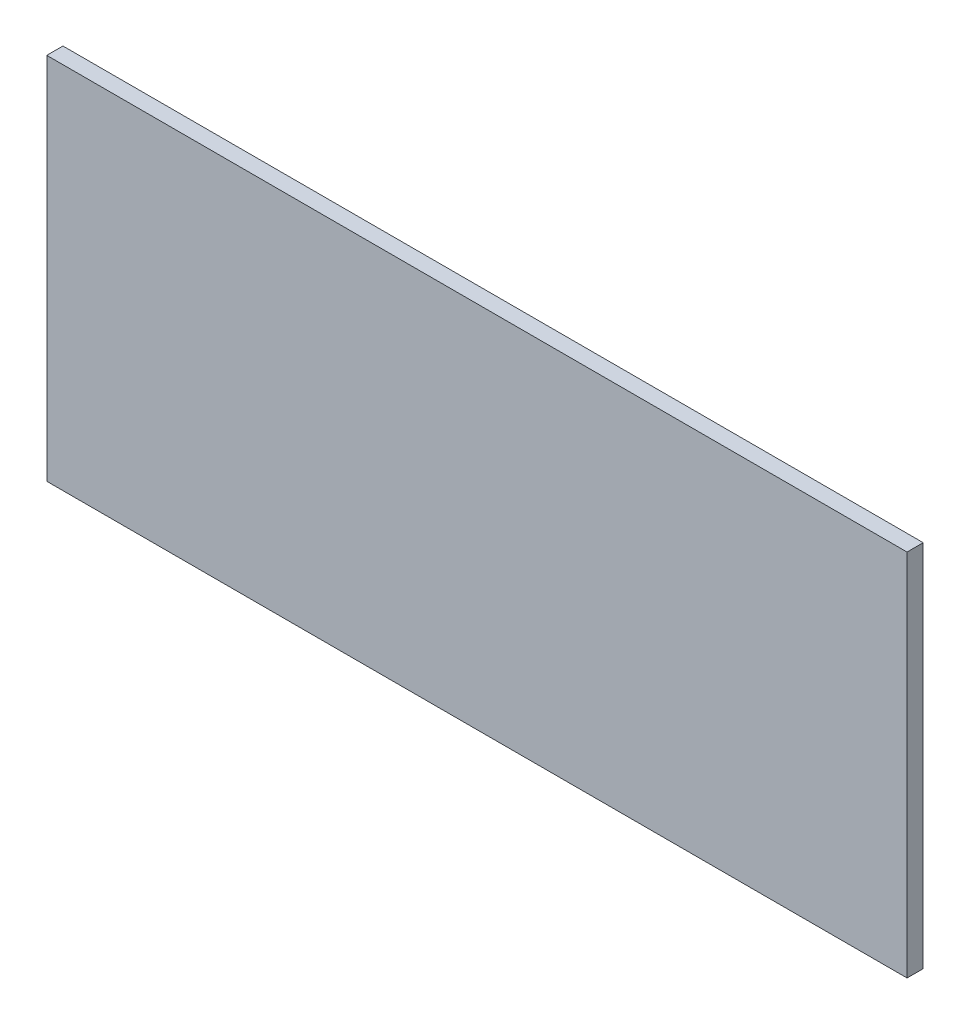
ISO-10303-21;
HEADER;
FILE_DESCRIPTION(('STEP AP214'),'2;1');
FILE_NAME('part.step','',(''),(''),'','','');
FILE_SCHEMA(('AUTOMOTIVE_DESIGN { 1 0 10303 214 1 1 1 1 }'));
ENDSEC;
DATA;
#1=APPLICATION_CONTEXT('core data for automotive mechanical design processes');
#2=APPLICATION_PROTOCOL_DEFINITION('international standard','automotive_design',2000,#1);
#3=PRODUCT_CONTEXT('',#1,'mechanical');
#4=PRODUCT('Part','Part','',(#3));
#5=PRODUCT_RELATED_PRODUCT_CATEGORY('part','',(#4));
#6=PRODUCT_DEFINITION_FORMATION('','',#4);
#7=PRODUCT_DEFINITION_CONTEXT('part definition',#1,'design');
#8=PRODUCT_DEFINITION('design','',#6,#7);
#9=PRODUCT_DEFINITION_SHAPE('','',#8);
#10=(LENGTH_UNIT() NAMED_UNIT(*) SI_UNIT(.MILLI.,.METRE.));
#11=(NAMED_UNIT(*) PLANE_ANGLE_UNIT() SI_UNIT($,.RADIAN.));
#12=(NAMED_UNIT(*) SI_UNIT($,.STERADIAN.) SOLID_ANGLE_UNIT());
#13=UNCERTAINTY_MEASURE_WITH_UNIT(LENGTH_MEASURE(1.E-05),#10,'distance_accuracy_value','');
#14=(GEOMETRIC_REPRESENTATION_CONTEXT(3) GLOBAL_UNCERTAINTY_ASSIGNED_CONTEXT((#13)) GLOBAL_UNIT_ASSIGNED_CONTEXT((#10,
#11,#12)) REPRESENTATION_CONTEXT('',''));
#15=CARTESIAN_POINT('',(0.,0.,0.));
#16=DIRECTION('',(0.,0.,1.));
#17=DIRECTION('',(1.,0.,0.));
#18=AXIS2_PLACEMENT_3D('',#15,#16,#17);
#19=CARTESIAN_POINT('',(79.7872907524784,-34.2134243458475,-3.));
#20=DIRECTION('',(1.,0.,0.));
#21=DIRECTION('',(0.,0.,-1.));
#22=AXIS2_PLACEMENT_3D('',#19,#20,#21);
#23=PLANE('',#22);
#24=DIRECTION('',(0.,1.,0.));
#25=VECTOR('',#24,1.);
#26=CARTESIAN_POINT('',(79.7872907524784,-34.2134243458475,0.));
#27=LINE('',#26,#25);
#28=CARTESIAN_POINT('',(79.7872907524784,-34.2134243458475,0.));
#29=VERTEX_POINT('',#28);
#30=CARTESIAN_POINT('',(79.7872907524784,34.2134243458475,0.));
#31=VERTEX_POINT('',#30);
#32=EDGE_CURVE('E115',#29,#31,#27,.T.);
#33=ORIENTED_EDGE('',*,*,#32,.F.);
#34=DIRECTION('',(0.,0.,1.));
#35=VECTOR('',#34,1.);
#36=CARTESIAN_POINT('',(79.7872907524784,-34.2134243458475,-3.));
#37=LINE('',#36,#35);
#38=CARTESIAN_POINT('',(79.7872907524784,-34.2134243458475,-3.));
#39=VERTEX_POINT('',#38);
#40=EDGE_CURVE('E11',#39,#29,#37,.T.);
#41=ORIENTED_EDGE('',*,*,#40,.F.);
#42=DIRECTION('',(0.,1.,0.));
#43=VECTOR('',#42,1.);
#44=CARTESIAN_POINT('',(79.7872907524784,-34.2134243458475,-3.));
#45=LINE('',#44,#43);
#46=CARTESIAN_POINT('',(79.7872907524784,34.2134243458475,-3.));
#47=VERTEX_POINT('',#46);
#48=EDGE_CURVE('E107',#39,#47,#45,.T.);
#49=ORIENTED_EDGE('',*,*,#48,.T.);
#50=DIRECTION('',(0.,0.,1.));
#51=VECTOR('',#50,1.);
#52=CARTESIAN_POINT('',(79.7872907524784,34.2134243458475,-3.));
#53=LINE('',#52,#51);
#54=EDGE_CURVE('E48',#47,#31,#53,.T.);
#55=ORIENTED_EDGE('',*,*,#54,.T.);
#56=EDGE_LOOP('',(#33,#41,#49,#55));
#57=FACE_BOUND('',#56,.T.);
#58=ADVANCED_FACE('F45',(#57),#23,.T.);
#59=CARTESIAN_POINT('',(-79.7872907524784,-34.2134243458475,-3.));
#60=DIRECTION('',(0.,-1.,0.));
#61=DIRECTION('',(0.,0.,-1.));
#62=AXIS2_PLACEMENT_3D('',#59,#60,#61);
#63=PLANE('',#62);
#64=DIRECTION('',(1.,0.,0.));
#65=VECTOR('',#64,1.);
#66=CARTESIAN_POINT('',(-79.7872907524784,-34.2134243458475,0.));
#67=LINE('',#66,#65);
#68=CARTESIAN_POINT('',(-79.7872907524784,-34.2134243458475,0.));
#69=VERTEX_POINT('',#68);
#70=EDGE_CURVE('E110',#69,#29,#67,.T.);
#71=ORIENTED_EDGE('',*,*,#70,.F.);
#72=DIRECTION('',(0.,0.,1.));
#73=VECTOR('',#72,1.);
#74=CARTESIAN_POINT('',(-79.7872907524784,-34.2134243458475,-3.));
#75=LINE('',#74,#73);
#76=CARTESIAN_POINT('',(-79.7872907524784,-34.2134243458475,-3.));
#77=VERTEX_POINT('',#76);
#78=EDGE_CURVE('E55',#77,#69,#75,.T.);
#79=ORIENTED_EDGE('',*,*,#78,.F.);
#80=DIRECTION('',(1.,0.,0.));
#81=VECTOR('',#80,1.);
#82=CARTESIAN_POINT('',(-79.7872907524784,-34.2134243458475,-3.));
#83=LINE('',#82,#81);
#84=EDGE_CURVE('E102',#77,#39,#83,.T.);
#85=ORIENTED_EDGE('',*,*,#84,.T.);
#86=ORIENTED_EDGE('',*,*,#40,.T.);
#87=EDGE_LOOP('',(#71,#79,#85,#86));
#88=FACE_BOUND('',#87,.T.);
#89=ADVANCED_FACE('F131',(#88),#63,.T.);
#90=CARTESIAN_POINT('',(-79.7872907524784,-34.2134243458475,-3.));
#91=DIRECTION('',(-1.,0.,0.));
#92=DIRECTION('',(0.,0.,1.));
#93=AXIS2_PLACEMENT_3D('',#90,#91,#92);
#94=PLANE('',#93);
#95=DIRECTION('',(0.,-1.,0.));
#96=VECTOR('',#95,1.);
#97=CARTESIAN_POINT('',(-79.7872907524784,-34.2134243458475,0.));
#98=LINE('',#97,#96);
#99=CARTESIAN_POINT('',(-79.7872907524784,34.2134243458475,0.));
#100=VERTEX_POINT('',#99);
#101=EDGE_CURVE('E96',#100,#69,#98,.T.);
#102=ORIENTED_EDGE('',*,*,#101,.F.);
#103=DIRECTION('',(0.,0.,1.));
#104=VECTOR('',#103,1.);
#105=CARTESIAN_POINT('',(-79.7872907524784,34.2134243458475,-3.));
#106=LINE('',#105,#104);
#107=CARTESIAN_POINT('',(-79.7872907524784,34.2134243458475,-3.));
#108=VERTEX_POINT('',#107);
#109=EDGE_CURVE('E91',#108,#100,#106,.T.);
#110=ORIENTED_EDGE('',*,*,#109,.F.);
#111=DIRECTION('',(0.,-1.,0.));
#112=VECTOR('',#111,1.);
#113=CARTESIAN_POINT('',(-79.7872907524784,-34.2134243458475,-3.));
#114=LINE('',#113,#112);
#115=EDGE_CURVE('E94',#108,#77,#114,.T.);
#116=ORIENTED_EDGE('',*,*,#115,.T.);
#117=ORIENTED_EDGE('',*,*,#78,.T.);
#118=EDGE_LOOP('',(#102,#110,#116,#117));
#119=FACE_BOUND('',#118,.T.);
#120=ADVANCED_FACE('F93',(#119),#94,.T.);
#121=CARTESIAN_POINT('',(-79.7872907524784,34.2134243458475,-3.));
#122=DIRECTION('',(0.,1.,0.));
#123=DIRECTION('',(0.,0.,1.));
#124=AXIS2_PLACEMENT_3D('',#121,#122,#123);
#125=PLANE('',#124);
#126=DIRECTION('',(-1.,0.,0.));
#127=VECTOR('',#126,1.);
#128=CARTESIAN_POINT('',(-79.7872907524784,34.2134243458475,0.));
#129=LINE('',#128,#127);
#130=EDGE_CURVE('E119',#31,#100,#129,.T.);
#131=ORIENTED_EDGE('',*,*,#130,.F.);
#132=ORIENTED_EDGE('',*,*,#54,.F.);
#133=DIRECTION('',(-1.,0.,0.));
#134=VECTOR('',#133,1.);
#135=CARTESIAN_POINT('',(-79.7872907524784,34.2134243458475,-3.));
#136=LINE('',#135,#134);
#137=EDGE_CURVE('E101',#47,#108,#136,.T.);
#138=ORIENTED_EDGE('',*,*,#137,.T.);
#139=ORIENTED_EDGE('',*,*,#109,.T.);
#140=EDGE_LOOP('',(#131,#132,#138,#139));
#141=FACE_BOUND('',#140,.T.);
#142=ADVANCED_FACE('F105',(#141),#125,.T.);
#143=CARTESIAN_POINT('',(0.,0.,-3.));
#144=DIRECTION('',(0.,0.,-1.));
#145=DIRECTION('',(-1.,0.,0.));
#146=AXIS2_PLACEMENT_3D('',#143,#144,#145);
#147=PLANE('',#146);
#148=ORIENTED_EDGE('',*,*,#48,.F.);
#149=ORIENTED_EDGE('',*,*,#84,.F.);
#150=ORIENTED_EDGE('',*,*,#115,.F.);
#151=ORIENTED_EDGE('',*,*,#137,.F.);
#152=EDGE_LOOP('',(#148,#149,#150,#151));
#153=FACE_BOUND('',#152,.T.);
#154=ADVANCED_FACE('F100',(#153),#147,.T.);
#155=CARTESIAN_POINT('',(0.,0.,0.));
#156=DIRECTION('',(0.,0.,-1.));
#157=DIRECTION('',(-1.,0.,0.));
#158=AXIS2_PLACEMENT_3D('',#155,#156,#157);
#159=PLANE('',#158);
#160=ORIENTED_EDGE('',*,*,#32,.T.);
#161=ORIENTED_EDGE('',*,*,#130,.T.);
#162=ORIENTED_EDGE('',*,*,#101,.T.);
#163=ORIENTED_EDGE('',*,*,#70,.T.);
#164=EDGE_LOOP('',(#160,#161,#162,#163));
#165=FACE_BOUND('',#164,.T.);
#166=ADVANCED_FACE('F130',(#165),#159,.F.);
#167=CLOSED_SHELL('',(#58,#89,#120,#142,#154,#166));
#168=MANIFOLD_SOLID_BREP('B2',#167);
#169=ADVANCED_BREP_SHAPE_REPRESENTATION('',(#18,#168),#14);
#170=SHAPE_DEFINITION_REPRESENTATION(#9,#169);
ENDSEC;
END-ISO-10303-21;
